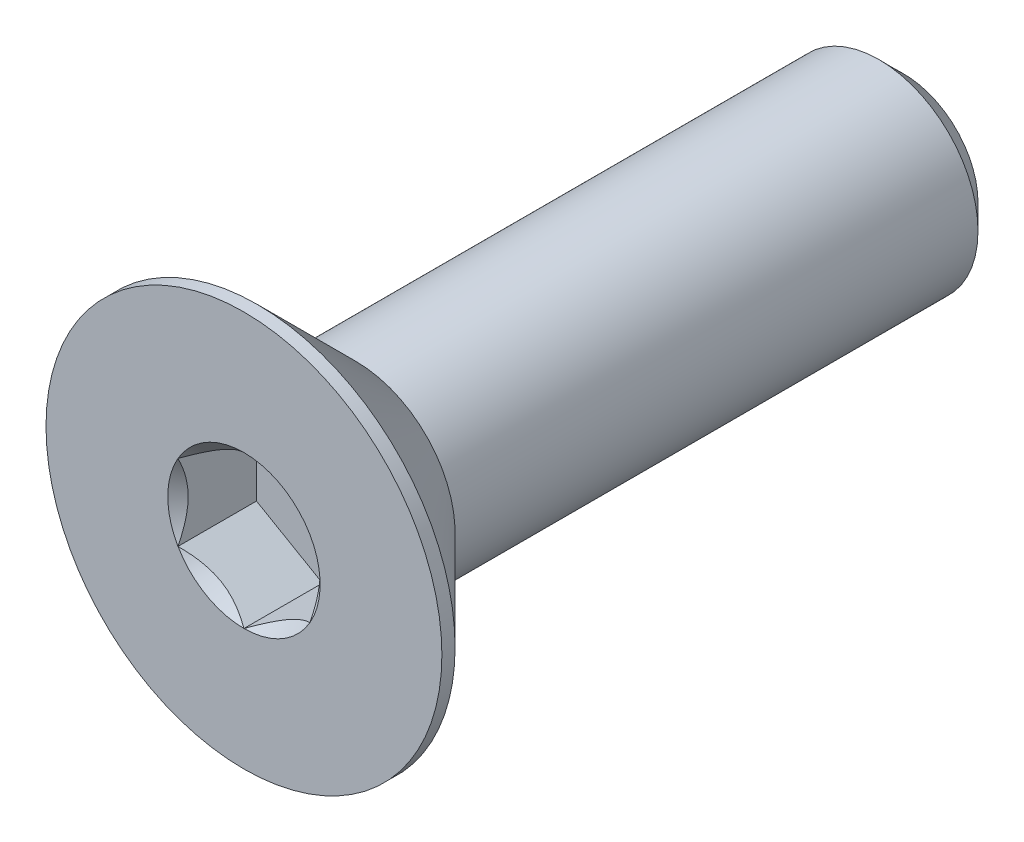
ISO-10303-21;
HEADER;
FILE_DESCRIPTION(('STEP AP214'),'2;1');
FILE_NAME('part.step','',(''),(''),'','','');
FILE_SCHEMA(('AUTOMOTIVE_DESIGN { 1 0 10303 214 1 1 1 1 }'));
ENDSEC;
DATA;
#1=APPLICATION_CONTEXT('core data for automotive mechanical design processes');
#2=APPLICATION_PROTOCOL_DEFINITION('international standard','automotive_design',2000,#1);
#3=PRODUCT_CONTEXT('',#1,'mechanical');
#4=PRODUCT('Part','Part','',(#3));
#5=PRODUCT_RELATED_PRODUCT_CATEGORY('part','',(#4));
#6=PRODUCT_DEFINITION_FORMATION('','',#4);
#7=PRODUCT_DEFINITION_CONTEXT('part definition',#1,'design');
#8=PRODUCT_DEFINITION('design','',#6,#7);
#9=PRODUCT_DEFINITION_SHAPE('','',#8);
#10=(LENGTH_UNIT() NAMED_UNIT(*) SI_UNIT(.MILLI.,.METRE.));
#11=(NAMED_UNIT(*) PLANE_ANGLE_UNIT() SI_UNIT($,.RADIAN.));
#12=(NAMED_UNIT(*) SI_UNIT($,.STERADIAN.) SOLID_ANGLE_UNIT());
#13=UNCERTAINTY_MEASURE_WITH_UNIT(LENGTH_MEASURE(1.E-05),#10,'distance_accuracy_value','');
#14=(GEOMETRIC_REPRESENTATION_CONTEXT(3) GLOBAL_UNCERTAINTY_ASSIGNED_CONTEXT((#13)) GLOBAL_UNIT_ASSIGNED_CONTEXT((#10,
#11,#12)) REPRESENTATION_CONTEXT('',''));
#15=CARTESIAN_POINT('',(0.,0.,0.));
#16=DIRECTION('',(0.,0.,1.));
#17=DIRECTION('',(1.,0.,0.));
#18=AXIS2_PLACEMENT_3D('',#15,#16,#17);
#19=CARTESIAN_POINT('',(1.,-0.577350269189626,-1.19));
#20=DIRECTION('',(0.,0.,1.));
#21=DIRECTION('',(1.,0.,0.));
#22=AXIS2_PLACEMENT_3D('',#19,#20,#21);
#23=PLANE('',#22);
#24=DIRECTION('',(0.,1.,0.));
#25=VECTOR('',#24,1.);
#26=CARTESIAN_POINT('',(-1.,0.577350269189626,-1.19));
#27=LINE('',#26,#25);
#28=CARTESIAN_POINT('',(-0.999999999999999,0.577350269189625,-1.19));
#29=VERTEX_POINT('',#28);
#30=CARTESIAN_POINT('',(-1.,-0.577350269189626,-1.19));
#31=VERTEX_POINT('',#30);
#32=EDGE_CURVE('E82',#29,#31,#27,.F.);
#33=ORIENTED_EDGE('',*,*,#32,.T.);
#34=DIRECTION('',(0.866025403784439,-0.5,0.));
#35=VECTOR('',#34,1.);
#36=CARTESIAN_POINT('',(-1.,-0.577350269189626,-1.19));
#37=LINE('',#36,#35);
#38=CARTESIAN_POINT('',(0.,-1.15470053837925,-1.19));
#39=VERTEX_POINT('',#38);
#40=EDGE_CURVE('E84',#31,#39,#37,.T.);
#41=ORIENTED_EDGE('',*,*,#40,.T.);
#42=DIRECTION('',(0.866025403784439,0.5,0.));
#43=VECTOR('',#42,1.);
#44=CARTESIAN_POINT('',(0.,-1.15470053837925,-1.19));
#45=LINE('',#44,#43);
#46=CARTESIAN_POINT('',(1.,-0.577350269189626,-1.19));
#47=VERTEX_POINT('',#46);
#48=EDGE_CURVE('E85',#39,#47,#45,.T.);
#49=ORIENTED_EDGE('',*,*,#48,.T.);
#50=DIRECTION('',(0.,1.,0.));
#51=VECTOR('',#50,1.);
#52=CARTESIAN_POINT('',(1.,-0.577350269189626,-1.19));
#53=LINE('',#52,#51);
#54=CARTESIAN_POINT('',(1.,0.577350269189626,-1.19));
#55=VERTEX_POINT('',#54);
#56=EDGE_CURVE('E71',#47,#55,#53,.T.);
#57=ORIENTED_EDGE('',*,*,#56,.T.);
#58=DIRECTION('',(-0.866025403784439,0.5,0.));
#59=VECTOR('',#58,1.);
#60=CARTESIAN_POINT('',(1.,0.577350269189626,-1.19));
#61=LINE('',#60,#59);
#62=CARTESIAN_POINT('',(0.,1.15470053837925,-1.19));
#63=VERTEX_POINT('',#62);
#64=EDGE_CURVE('E110',#55,#63,#61,.T.);
#65=ORIENTED_EDGE('',*,*,#64,.T.);
#66=DIRECTION('',(-0.866025403784439,-0.5,0.));
#67=VECTOR('',#66,1.);
#68=CARTESIAN_POINT('',(0.,1.15470053837925,-1.19));
#69=LINE('',#68,#67);
#70=EDGE_CURVE('E115',#63,#29,#69,.T.);
#71=ORIENTED_EDGE('',*,*,#70,.T.);
#72=EDGE_LOOP('',(#33,#41,#49,#57,#65,#71));
#73=FACE_BOUND('',#72,.T.);
#74=ADVANCED_FACE('F16',(#73),#23,.T.);
#75=CARTESIAN_POINT('',(0.,-1.15470053837925,-1.19));
#76=DIRECTION('',(0.5,-0.866025403784439,0.));
#77=DIRECTION('',(0.866025403784439,0.5,0.));
#78=AXIS2_PLACEMENT_3D('',#75,#76,#77);
#79=PLANE('',#78);
#80=CARTESIAN_POINT('',(-3.93149117159769E-11,-1.15470053837926,-9.98108794507433E-11));
#81=CARTESIAN_POINT('',(0.0343705355201057,-1.13485670043636,-0.019824700422141));
#82=CARTESIAN_POINT('',(0.0693156756519455,-1.11468111438035,-0.0384849664872145));
#83=CARTESIAN_POINT('',(0.140572403035621,-1.07354102364821,-0.0726511232407905));
#84=CARTESIAN_POINT('',(0.176890763106012,-1.05257260868342,-0.0881380101422933));
#85=CARTESIAN_POINT('',(0.250125097696328,-1.01029074589262,-0.11466695978462));
#86=CARTESIAN_POINT('',(0.287022429458597,-0.988988061467716,-0.125775687570534));
#87=CARTESIAN_POINT('',(0.361628600499482,-0.945914168534358,-0.142891513233382));
#88=CARTESIAN_POINT('',(0.399335163701569,-0.924144274119301,-0.148911380305544));
#89=CARTESIAN_POINT('',(0.464327716043936,-0.886620806529054,-0.154341115390247));
#90=CARTESIAN_POINT('',(0.491529304810035,-0.87091596193258,-0.155143433217331));
#91=CARTESIAN_POINT('',(0.545879708710831,-0.839536741609904,-0.153791220399352));
#92=CARTESIAN_POINT('',(0.573028510861523,-0.823862373380022,-0.151636036594819));
#93=CARTESIAN_POINT('',(0.654087027893978,-0.777063216751215,-0.140876680449877));
#94=CARTESIAN_POINT('',(0.707593237347495,-0.746171392319914,-0.127977491939688));
#95=CARTESIAN_POINT('',(0.801462739355952,-0.691975810066637,-0.0968623195341796));
#96=CARTESIAN_POINT('',(0.842267871071583,-0.668416956286299,-0.0802830124023648));
#97=CARTESIAN_POINT('',(0.922281198810023,-0.622221239977752,-0.0429387151524039));
#98=CARTESIAN_POINT('',(0.961494106307927,-0.599581657278129,-0.0221873504710733));
#99=CARTESIAN_POINT('',(1.00000000003183,-0.577350269171246,-1.09229319045489E-10));
#100=B_SPLINE_CURVE_WITH_KNOTS('',3,(#80,#81,#82,#83,#84,#85,#86,#87,#88,#89,#90,#91,#92,#93,
#94,#95,#96,#97,#98,#99),.UNSPECIFIED.,.F.,.F.,(4,2,2,2,2,2,2,2,2,4),(0.,0.133182946587487,
0.267141541479663,0.398973326833972,0.530473323727982,0.624596460473079,0.718740387507005,
0.907081600610891,1.05673041335255,1.20589820631879),.UNSPECIFIED.);
#101=CARTESIAN_POINT('',(0.,-1.15470053839843,-1.08428123155448E-10));
#102=VERTEX_POINT('',#101);
#103=CARTESIAN_POINT('',(1.00000000001661,-0.577350269199215,-1.08427884492241E-10));
#104=VERTEX_POINT('',#103);
#105=EDGE_CURVE('E19',#102,#104,#100,.T.);
#106=ORIENTED_EDGE('',*,*,#105,.T.);
#107=DIRECTION('',(0.,0.,-1.));
#108=VECTOR('',#107,1.);
#109=CARTESIAN_POINT('',(1.,-0.577350269189626,-1.19));
#110=LINE('',#109,#108);
#111=EDGE_CURVE('E90',#104,#47,#110,.T.);
#112=ORIENTED_EDGE('',*,*,#111,.T.);
#113=ORIENTED_EDGE('',*,*,#48,.F.);
#114=DIRECTION('',(0.,0.,1.));
#115=VECTOR('',#114,1.);
#116=CARTESIAN_POINT('',(0.,-1.15470053837925,-1.19));
#117=LINE('',#116,#115);
#118=EDGE_CURVE('E58',#39,#102,#117,.T.);
#119=ORIENTED_EDGE('',*,*,#118,.T.);
#120=EDGE_LOOP('',(#106,#112,#113,#119));
#121=FACE_BOUND('',#120,.T.);
#122=ADVANCED_FACE('F89',(#121),#79,.F.);
#123=CARTESIAN_POINT('',(-1.,-0.577350269189626,-1.19));
#124=DIRECTION('',(-0.5,-0.866025403784439,0.));
#125=DIRECTION('',(0.866025403784439,-0.5,0.));
#126=AXIS2_PLACEMENT_3D('',#123,#124,#125);
#127=PLANE('',#126);
#128=CARTESIAN_POINT('',(-1.00000000001966,-0.577350269155583,-9.98096276046598E-11));
#129=CARTESIAN_POINT('',(-0.965629464472823,-0.597194107120269,-0.0198247004221396));
#130=CARTESIAN_POINT('',(-0.930684324346155,-0.617369693185242,-0.0384849664872131));
#131=CARTESIAN_POINT('',(-0.859427596966287,-0.658509783923978,-0.0726511232407891));
#132=CARTESIAN_POINT('',(-0.823109236894494,-0.679478198886334,-0.0881380101422919));
#133=CARTESIAN_POINT('',(-0.749874902303172,-0.721760061675394,-0.114666959784619));
#134=CARTESIAN_POINT('',(-0.71297757054127,-0.743062746100931,-0.125775687570532));
#135=CARTESIAN_POINT('',(-0.638371399500649,-0.786136639034746,-0.14289151323338));
#136=CARTESIAN_POINT('',(-0.600664836298461,-0.807906533449627,-0.148911380305542));
#137=CARTESIAN_POINT('',(-0.535672283956042,-0.845430001039785,-0.154341115390246));
#138=CARTESIAN_POINT('',(-0.508470695189959,-0.861134845636286,-0.155143433217329));
#139=CARTESIAN_POINT('',(-0.454120291289175,-0.892514065958982,-0.15379122039935));
#140=CARTESIAN_POINT('',(-0.426971489138479,-0.908188434188858,-0.151636036594817));
#141=CARTESIAN_POINT('',(-0.345912972106017,-0.954987590817655,-0.140876680449876));
#142=CARTESIAN_POINT('',(-0.292406762652503,-0.985879415248961,-0.127977491939686));
#143=CARTESIAN_POINT('',(-0.198537260644048,-1.04007499750224,-0.0968623195341786));
#144=CARTESIAN_POINT('',(-0.157732128928417,-1.06363385128258,-0.0802830124023638));
#145=CARTESIAN_POINT('',(-0.0777188011899764,-1.10982956759112,-0.0429387151524029));
#146=CARTESIAN_POINT('',(-0.0385058936920724,-1.13246915029075,-0.0221873504710723));
#147=CARTESIAN_POINT('',(3.18328951443562E-11,-1.15470053839763,-1.09228385770901E-10));
#148=B_SPLINE_CURVE_WITH_KNOTS('',3,(#128,#129,#130,#131,#132,#133,#134,#135,#136,#137,#138,
#139,#140,#141,#142,#143,#144,#145,#146,#147),.UNSPECIFIED.,.F.,.F.,(4,2,2,2,2,2,2,2,2,4),(0.,
0.133182946587487,0.267141541479662,0.398973326833972,0.530473323727981,0.624596460473079,
0.718740387507004,0.907081600610891,1.05673041335255,1.20589820631879),.UNSPECIFIED.);
#149=CARTESIAN_POINT('',(-1.00000000001661,-0.577350269199216,-1.0842737551488E-10));
#150=VERTEX_POINT('',#149);
#151=EDGE_CURVE('E94',#150,#102,#148,.T.);
#152=ORIENTED_EDGE('',*,*,#151,.T.);
#153=ORIENTED_EDGE('',*,*,#118,.F.);
#154=ORIENTED_EDGE('',*,*,#40,.F.);
#155=DIRECTION('',(0.,0.,1.));
#156=VECTOR('',#155,1.);
#157=CARTESIAN_POINT('',(-1.,-0.577350269189626,-1.19));
#158=LINE('',#157,#156);
#159=EDGE_CURVE('E96',#31,#150,#158,.T.);
#160=ORIENTED_EDGE('',*,*,#159,.T.);
#161=EDGE_LOOP('',(#152,#153,#154,#160));
#162=FACE_BOUND('',#161,.T.);
#163=ADVANCED_FACE('F92',(#162),#127,.F.);
#164=CARTESIAN_POINT('',(-1.,0.577350269189626,-1.19));
#165=DIRECTION('',(-1.,0.,0.));
#166=DIRECTION('',(0.,0.,1.));
#167=AXIS2_PLACEMENT_3D('',#164,#165,#166);
#168=PLANE('',#167);
#169=CARTESIAN_POINT('',(-0.999999999980349,0.577350269223676,-9.98097329294954E-11));
#170=CARTESIAN_POINT('',(-0.999999999992929,0.537662593316093,-0.0198247004221396));
#171=CARTESIAN_POINT('',(-0.999999999998101,0.497311421195105,-0.0384849664872131));
#172=CARTESIAN_POINT('',(-1.00000000000191,0.41503123972423,-0.0726511232407892));
#173=CARTESIAN_POINT('',(-1.00000000000051,0.373094409797089,-0.0881380101422921));
#174=CARTESIAN_POINT('',(-0.999999999999501,0.288530684217224,-0.114666959784619));
#175=CARTESIAN_POINT('',(-0.999999999999868,0.245925315366786,-0.125775687570532));
#176=CARTESIAN_POINT('',(-1.00000000000013,0.159777529499614,-0.142891513233381));
#177=CARTESIAN_POINT('',(-1.00000000000003,0.116237740669674,-0.148911380305542));
#178=CARTESIAN_POINT('',(-0.999999999999979,0.0411908054892712,-0.154341115390246));
#179=CARTESIAN_POINT('',(-0.999999999999994,0.00978111629629506,-0.155143433217329));
#180=CARTESIAN_POINT('',(-1.00000000000001,-0.0529773243490767,-0.15379122039935));
#181=CARTESIAN_POINT('',(-1.,-0.0843260608088347,-0.151636036594817));
#182=CARTESIAN_POINT('',(-0.999999999999996,-0.177924374066439,-0.140876680449876));
#183=CARTESIAN_POINT('',(-0.999999999999999,-0.239708022929046,-0.127977491939686));
#184=CARTESIAN_POINT('',(-1.,-0.348099187435602,-0.0968623195341786));
#185=CARTESIAN_POINT('',(-1.,-0.395216894996278,-0.0802830124023637));
#186=CARTESIAN_POINT('',(-1.,-0.48760832761337,-0.0429387151524027));
#187=CARTESIAN_POINT('',(-0.999999999999999,-0.532887493012616,-0.0221873504710721));
#188=CARTESIAN_POINT('',(-1.,-0.577350269226384,-1.09228152961273E-10));
#189=B_SPLINE_CURVE_WITH_KNOTS('',3,(#169,#170,#171,#172,#173,#174,#175,#176,#177,#178,#179,
#180,#181,#182,#183,#184,#185,#186,#187,#188),.UNSPECIFIED.,.F.,.F.,(4,2,2,2,2,2,2,2,2,4),(0.,
0.133182946587487,0.267141541479662,0.398973326833972,0.530473323727981,0.624596460473079,
0.718740387507004,0.907081600610891,1.05673041335255,1.20589820631879),.UNSPECIFIED.);
#190=CARTESIAN_POINT('',(-1.00000000001661,0.577350269199215,-1.08428019358982E-10));
#191=VERTEX_POINT('',#190);
#192=EDGE_CURVE('E194',#191,#150,#189,.T.);
#193=ORIENTED_EDGE('',*,*,#192,.T.);
#194=ORIENTED_EDGE('',*,*,#159,.F.);
#195=ORIENTED_EDGE('',*,*,#32,.F.);
#196=DIRECTION('',(0.,0.,1.));
#197=VECTOR('',#196,1.);
#198=CARTESIAN_POINT('',(-0.999999999999999,0.577350269189625,-1.19));
#199=LINE('',#198,#197);
#200=EDGE_CURVE('E112',#29,#191,#199,.T.);
#201=ORIENTED_EDGE('',*,*,#200,.T.);
#202=EDGE_LOOP('',(#193,#194,#195,#201));
#203=FACE_BOUND('',#202,.T.);
#204=ADVANCED_FACE('F204',(#203),#168,.F.);
#205=CARTESIAN_POINT('',(0.,1.15470053837925,-1.19));
#206=DIRECTION('',(-0.5,0.866025403784439,0.));
#207=DIRECTION('',(-0.866025403784439,-0.5,0.));
#208=AXIS2_PLACEMENT_3D('',#205,#206,#207);
#209=PLANE('',#208);
#210=CARTESIAN_POINT('',(3.93151632829924E-11,1.15470053837926,-9.98107715657998E-11));
#211=CARTESIAN_POINT('',(-0.0343705355201053,1.13485670043636,-0.0198247004221408));
#212=CARTESIAN_POINT('',(-0.0693156756519452,1.11468111438035,-0.0384849664872144));
#213=CARTESIAN_POINT('',(-0.140572403035621,1.07354102364821,-0.0726511232407903));
#214=CARTESIAN_POINT('',(-0.176890763106012,1.05257260868342,-0.0881380101422931));
#215=CARTESIAN_POINT('',(-0.250125097696327,1.01029074589262,-0.11466695978462));
#216=CARTESIAN_POINT('',(-0.287022429458596,0.988988061467716,-0.125775687570534));
#217=CARTESIAN_POINT('',(-0.361628600499482,0.945914168534359,-0.142891513233382));
#218=CARTESIAN_POINT('',(-0.399335163701568,0.924144274119301,-0.148911380305543));
#219=CARTESIAN_POINT('',(-0.464327716043936,0.886620806529055,-0.154341115390247));
#220=CARTESIAN_POINT('',(-0.491529304810035,0.87091596193258,-0.155143433217331));
#221=CARTESIAN_POINT('',(-0.54587970871083,0.839536741609904,-0.153791220399352));
#222=CARTESIAN_POINT('',(-0.573028510861522,0.823862373380022,-0.151636036594819));
#223=CARTESIAN_POINT('',(-0.654087027893978,0.777063216751215,-0.140876680449878));
#224=CARTESIAN_POINT('',(-0.707593237347495,0.746171392319914,-0.127977491939688));
#225=CARTESIAN_POINT('',(-0.801462739355952,0.691975810066637,-0.0968623195341798));
#226=CARTESIAN_POINT('',(-0.842267871071583,0.668416956286299,-0.0802830124023649));
#227=CARTESIAN_POINT('',(-0.922281198810023,0.622221239977752,-0.0429387151524038));
#228=CARTESIAN_POINT('',(-0.961494106307926,0.599581657278129,-0.0221873504710732));
#229=CARTESIAN_POINT('',(-1.00000000003183,0.577350269171245,-1.09229129721644E-10));
#230=B_SPLINE_CURVE_WITH_KNOTS('',3,(#210,#211,#212,#213,#214,#215,#216,#217,#218,#219,#220,
#221,#222,#223,#224,#225,#226,#227,#228,#229),.UNSPECIFIED.,.F.,.F.,(4,2,2,2,2,2,2,2,2,4),(0.,
0.133182946587487,0.267141541479662,0.398973326833972,0.530473323727982,0.624596460473079,
0.718740387507005,0.907081600610891,1.05673041335255,1.20589820631879),.UNSPECIFIED.);
#231=CARTESIAN_POINT('',(0.,1.15470053839843,-1.08428125444796E-10));
#232=VERTEX_POINT('',#231);
#233=EDGE_CURVE('E186',#232,#191,#230,.T.);
#234=ORIENTED_EDGE('',*,*,#233,.T.);
#235=ORIENTED_EDGE('',*,*,#200,.F.);
#236=ORIENTED_EDGE('',*,*,#70,.F.);
#237=DIRECTION('',(0.,0.,1.));
#238=VECTOR('',#237,1.);
#239=CARTESIAN_POINT('',(0.,1.15470053837925,-1.19));
#240=LINE('',#239,#238);
#241=EDGE_CURVE('E107',#63,#232,#240,.T.);
#242=ORIENTED_EDGE('',*,*,#241,.T.);
#243=EDGE_LOOP('',(#234,#235,#236,#242));
#244=FACE_BOUND('',#243,.T.);
#245=ADVANCED_FACE('F200',(#244),#209,.F.);
#246=CARTESIAN_POINT('',(1.,0.577350269189626,-1.19));
#247=DIRECTION('',(0.5,0.866025403784439,0.));
#248=DIRECTION('',(-0.866025403784439,0.5,0.));
#249=AXIS2_PLACEMENT_3D('',#246,#247,#248);
#250=PLANE('',#249);
#251=CARTESIAN_POINT('',(1.00000000001966,0.577350269155583,-9.98095486581229E-11));
#252=CARTESIAN_POINT('',(0.965629464472823,0.597194107120269,-0.0198247004221397));
#253=CARTESIAN_POINT('',(0.930684324346155,0.617369693185242,-0.0384849664872132));
#254=CARTESIAN_POINT('',(0.859427596966287,0.658509783923978,-0.0726511232407891));
#255=CARTESIAN_POINT('',(0.823109236894494,0.679478198886334,-0.0881380101422918));
#256=CARTESIAN_POINT('',(0.749874902303172,0.721760061675394,-0.114666959784619));
#257=CARTESIAN_POINT('',(0.712977570541271,0.743062746100931,-0.125775687570532));
#258=CARTESIAN_POINT('',(0.638371399500649,0.786136639034746,-0.142891513233381));
#259=CARTESIAN_POINT('',(0.600664836298461,0.807906533449627,-0.148911380305542));
#260=CARTESIAN_POINT('',(0.535672283956042,0.845430001039784,-0.154341115390246));
#261=CARTESIAN_POINT('',(0.508470695189959,0.861134845636286,-0.155143433217329));
#262=CARTESIAN_POINT('',(0.454120291289175,0.892514065958982,-0.15379122039935));
#263=CARTESIAN_POINT('',(0.426971489138479,0.908188434188858,-0.151636036594817));
#264=CARTESIAN_POINT('',(0.345912972106017,0.954987590817654,-0.140876680449876));
#265=CARTESIAN_POINT('',(0.292406762652503,0.985879415248961,-0.127977491939686));
#266=CARTESIAN_POINT('',(0.198537260644048,1.04007499750224,-0.0968623195341785));
#267=CARTESIAN_POINT('',(0.157732128928417,1.06363385128258,-0.0802830124023638));
#268=CARTESIAN_POINT('',(0.0777188011899766,1.10982956759112,-0.042938715152403));
#269=CARTESIAN_POINT('',(0.0385058936920726,1.13246915029075,-0.0221873504710725));
#270=CARTESIAN_POINT('',(-3.18326351011692E-11,1.15470053839763,-1.0922858632033E-10));
#271=B_SPLINE_CURVE_WITH_KNOTS('',3,(#251,#252,#253,#254,#255,#256,#257,#258,#259,#260,#261,
#262,#263,#264,#265,#266,#267,#268,#269,#270),.UNSPECIFIED.,.F.,.F.,(4,2,2,2,2,2,2,2,2,4),(0.,
0.133182946587487,0.267141541479662,0.398973326833972,0.530473323727981,0.624596460473079,
0.718740387507004,0.907081600610891,1.05673041335255,1.20589820631879),.UNSPECIFIED.);
#272=CARTESIAN_POINT('',(1.00000000001661,0.577350269199216,-1.08427368443792E-10));
#273=VERTEX_POINT('',#272);
#274=EDGE_CURVE('E156',#273,#232,#271,.T.);
#275=ORIENTED_EDGE('',*,*,#274,.T.);
#276=ORIENTED_EDGE('',*,*,#241,.F.);
#277=ORIENTED_EDGE('',*,*,#64,.F.);
#278=DIRECTION('',(0.,0.,-1.));
#279=VECTOR('',#278,1.);
#280=CARTESIAN_POINT('',(1.,0.577350269189626,-1.19));
#281=LINE('',#280,#279);
#282=EDGE_CURVE('E39',#55,#273,#281,.F.);
#283=ORIENTED_EDGE('',*,*,#282,.T.);
#284=EDGE_LOOP('',(#275,#276,#277,#283));
#285=FACE_BOUND('',#284,.T.);
#286=ADVANCED_FACE('F203',(#285),#250,.F.);
#287=CARTESIAN_POINT('',(1.,-0.577350269189626,-1.19));
#288=DIRECTION('',(1.,0.,0.));
#289=DIRECTION('',(0.,0.,-1.));
#290=AXIS2_PLACEMENT_3D('',#287,#288,#289);
#291=PLANE('',#290);
#292=CARTESIAN_POINT('',(0.999999999980349,-0.577350269223676,-9.98095949384892E-11));
#293=CARTESIAN_POINT('',(0.999999999992929,-0.537662593316093,-0.0198247004221395));
#294=CARTESIAN_POINT('',(0.999999999998101,-0.497311421195106,-0.0384849664872131));
#295=CARTESIAN_POINT('',(1.00000000000191,-0.41503123972423,-0.0726511232407892));
#296=CARTESIAN_POINT('',(1.00000000000051,-0.373094409797089,-0.0881380101422921));
#297=CARTESIAN_POINT('',(0.999999999999501,-0.288530684217224,-0.114666959784619));
#298=CARTESIAN_POINT('',(0.999999999999868,-0.245925315366786,-0.125775687570532));
#299=CARTESIAN_POINT('',(1.00000000000013,-0.159777529499614,-0.142891513233381));
#300=CARTESIAN_POINT('',(1.00000000000003,-0.116237740669674,-0.148911380305542));
#301=CARTESIAN_POINT('',(0.999999999999979,-0.0411908054892709,-0.154341115390246));
#302=CARTESIAN_POINT('',(0.999999999999994,-0.00978111629629477,-0.155143433217329));
#303=CARTESIAN_POINT('',(1.00000000000001,0.052977324349077,-0.15379122039935));
#304=CARTESIAN_POINT('',(1.,0.084326060808835,-0.151636036594817));
#305=CARTESIAN_POINT('',(0.999999999999996,0.177924374066439,-0.140876680449876));
#306=CARTESIAN_POINT('',(0.999999999999999,0.239708022929047,-0.127977491939686));
#307=CARTESIAN_POINT('',(1.,0.348099187435603,-0.0968623195341784));
#308=CARTESIAN_POINT('',(1.,0.395216894996278,-0.0802830124023636));
#309=CARTESIAN_POINT('',(1.,0.48760832761337,-0.0429387151524028));
#310=CARTESIAN_POINT('',(0.999999999999999,0.532887493012616,-0.0221873504710722));
#311=CARTESIAN_POINT('',(1.,0.577350269226384,-1.09228152479802E-10));
#312=B_SPLINE_CURVE_WITH_KNOTS('',3,(#292,#293,#294,#295,#296,#297,#298,#299,#300,#301,#302,
#303,#304,#305,#306,#307,#308,#309,#310,#311),.UNSPECIFIED.,.F.,.F.,(4,2,2,2,2,2,2,2,2,4),(0.,
0.133182946587487,0.267141541479663,0.398973326833972,0.530473323727982,0.624596460473079,
0.718740387507005,0.907081600610892,1.05673041335255,1.20589820631879),.UNSPECIFIED.);
#313=EDGE_CURVE('E148',#104,#273,#312,.T.);
#314=ORIENTED_EDGE('',*,*,#313,.T.);
#315=ORIENTED_EDGE('',*,*,#282,.F.);
#316=ORIENTED_EDGE('',*,*,#56,.F.);
#317=ORIENTED_EDGE('',*,*,#111,.F.);
#318=EDGE_LOOP('',(#314,#315,#316,#317));
#319=FACE_BOUND('',#318,.T.);
#320=ADVANCED_FACE('F164',(#319),#291,.F.);
#321=CARTESIAN_POINT('',(0.,0.,-1.70530256582424E-10));
#322=DIRECTION('',(0.,0.,1.));
#323=DIRECTION('',(1.,0.,0.));
#324=AXIS2_PLACEMENT_3D('',#321,#322,#323);
#325=CONICAL_SURFACE('',#324,1.15470053833633,0.785398163397448);
#326=ORIENTED_EDGE('',*,*,#105,.F.);
#327=CARTESIAN_POINT('',(0.,0.,-1.13686837721616E-10));
#328=DIRECTION('',(0.,0.,1.));
#329=DIRECTION('',(1.,0.,0.));
#330=AXIS2_PLACEMENT_3D('',#327,#328,#329);
#331=CIRCLE('',#330,1.15470053839317);
#332=EDGE_CURVE('E145',#104,#102,#331,.F.);
#333=ORIENTED_EDGE('',*,*,#332,.F.);
#334=EDGE_LOOP('',(#326,#333));
#335=FACE_BOUND('',#334,.T.);
#336=ADVANCED_FACE('F221',(#335),#325,.F.);
#337=CARTESIAN_POINT('',(0.,0.,-1.70530256582424E-10));
#338=DIRECTION('',(0.,0.,1.));
#339=DIRECTION('',(1.,0.,0.));
#340=AXIS2_PLACEMENT_3D('',#337,#338,#339);
#341=CONICAL_SURFACE('',#340,1.15470053833633,0.785398163397448);
#342=ORIENTED_EDGE('',*,*,#151,.F.);
#343=CARTESIAN_POINT('',(0.,0.,-1.13686837721616E-10));
#344=DIRECTION('',(0.,0.,1.));
#345=DIRECTION('',(1.,0.,0.));
#346=AXIS2_PLACEMENT_3D('',#343,#344,#345);
#347=CIRCLE('',#346,1.15470053839317);
#348=EDGE_CURVE('E142',#102,#150,#347,.F.);
#349=ORIENTED_EDGE('',*,*,#348,.F.);
#350=EDGE_LOOP('',(#342,#349));
#351=FACE_BOUND('',#350,.T.);
#352=ADVANCED_FACE('F218',(#351),#341,.F.);
#353=CARTESIAN_POINT('',(0.,0.,-1.70530256582424E-10));
#354=DIRECTION('',(0.,0.,1.));
#355=DIRECTION('',(1.,0.,0.));
#356=AXIS2_PLACEMENT_3D('',#353,#354,#355);
#357=CONICAL_SURFACE('',#356,1.15470053833633,0.785398163397448);
#358=ORIENTED_EDGE('',*,*,#192,.F.);
#359=CARTESIAN_POINT('',(0.,0.,-1.13686837721616E-10));
#360=DIRECTION('',(0.,0.,1.));
#361=DIRECTION('',(1.,0.,0.));
#362=AXIS2_PLACEMENT_3D('',#359,#360,#361);
#363=CIRCLE('',#362,1.15470053839317);
#364=EDGE_CURVE('E139',#150,#191,#363,.F.);
#365=ORIENTED_EDGE('',*,*,#364,.F.);
#366=EDGE_LOOP('',(#358,#365));
#367=FACE_BOUND('',#366,.T.);
#368=ADVANCED_FACE('F182',(#367),#357,.F.);
#369=CARTESIAN_POINT('',(0.,0.,-1.70530256582424E-10));
#370=DIRECTION('',(0.,0.,1.));
#371=DIRECTION('',(1.,0.,0.));
#372=AXIS2_PLACEMENT_3D('',#369,#370,#371);
#373=CONICAL_SURFACE('',#372,1.15470053833633,0.785398163397448);
#374=ORIENTED_EDGE('',*,*,#233,.F.);
#375=CARTESIAN_POINT('',(0.,0.,-1.13686837721616E-10));
#376=DIRECTION('',(0.,0.,1.));
#377=DIRECTION('',(1.,0.,0.));
#378=AXIS2_PLACEMENT_3D('',#375,#376,#377);
#379=CIRCLE('',#378,1.15470053839317);
#380=EDGE_CURVE('E136',#191,#232,#379,.F.);
#381=ORIENTED_EDGE('',*,*,#380,.F.);
#382=EDGE_LOOP('',(#374,#381));
#383=FACE_BOUND('',#382,.T.);
#384=ADVANCED_FACE('F177',(#383),#373,.F.);
#385=CARTESIAN_POINT('',(0.,0.,-1.70530256582424E-10));
#386=DIRECTION('',(0.,0.,1.));
#387=DIRECTION('',(1.,0.,0.));
#388=AXIS2_PLACEMENT_3D('',#385,#386,#387);
#389=CONICAL_SURFACE('',#388,1.15470053833633,0.785398163397448);
#390=ORIENTED_EDGE('',*,*,#274,.F.);
#391=CARTESIAN_POINT('',(0.,0.,-1.13686837721616E-10));
#392=DIRECTION('',(0.,0.,1.));
#393=DIRECTION('',(1.,0.,0.));
#394=AXIS2_PLACEMENT_3D('',#391,#392,#393);
#395=CIRCLE('',#394,1.15470053839317);
#396=EDGE_CURVE('E133',#232,#273,#395,.F.);
#397=ORIENTED_EDGE('',*,*,#396,.F.);
#398=EDGE_LOOP('',(#390,#397));
#399=FACE_BOUND('',#398,.T.);
#400=ADVANCED_FACE('F171',(#399),#389,.F.);
#401=CARTESIAN_POINT('',(0.,0.,-1.70530256582424E-10));
#402=DIRECTION('',(0.,0.,1.));
#403=DIRECTION('',(1.,0.,0.));
#404=AXIS2_PLACEMENT_3D('',#401,#402,#403);
#405=CONICAL_SURFACE('',#404,1.15470053833633,0.785398163397448);
#406=CARTESIAN_POINT('',(0.,0.,-1.13686837721616E-10));
#407=DIRECTION('',(0.,0.,1.));
#408=DIRECTION('',(1.,0.,0.));
#409=AXIS2_PLACEMENT_3D('',#406,#407,#408);
#410=CIRCLE('',#409,1.15470053839317);
#411=EDGE_CURVE('E130',#273,#104,#410,.F.);
#412=ORIENTED_EDGE('',*,*,#411,.F.);
#413=ORIENTED_EDGE('',*,*,#313,.F.);
#414=EDGE_LOOP('',(#412,#413));
#415=FACE_BOUND('',#414,.T.);
#416=ADVANCED_FACE('F166',(#415),#405,.F.);
#417=CARTESIAN_POINT('',(0.,-1.5,0.));
#418=DIRECTION('',(0.,0.,1.));
#419=DIRECTION('',(0.,-1.,0.));
#420=AXIS2_PLACEMENT_3D('',#417,#418,#419);
#421=PLANE('',#420);
#422=ORIENTED_EDGE('',*,*,#396,.T.);
#423=ORIENTED_EDGE('',*,*,#411,.T.);
#424=ORIENTED_EDGE('',*,*,#332,.T.);
#425=ORIENTED_EDGE('',*,*,#348,.T.);
#426=ORIENTED_EDGE('',*,*,#364,.T.);
#427=ORIENTED_EDGE('',*,*,#380,.T.);
#428=EDGE_LOOP('',(#422,#423,#424,#425,#426,#427));
#429=FACE_BOUND('',#428,.T.);
#430=CARTESIAN_POINT('',(0.,0.,0.));
#431=DIRECTION('',(0.,0.,1.));
#432=DIRECTION('',(0.,-1.,0.));
#433=AXIS2_PLACEMENT_3D('',#430,#431,#432);
#434=CIRCLE('',#433,3.);
#435=CARTESIAN_POINT('',(0.,-3.,0.));
#436=VERTEX_POINT('',#435);
#437=EDGE_CURVE('E127',#436,#436,#434,.F.);
#438=ORIENTED_EDGE('',*,*,#437,.F.);
#439=EDGE_LOOP('',(#438));
#440=FACE_BOUND('',#439,.T.);
#441=ADVANCED_FACE('F170',(#429,#440),#421,.T.);
#442=CARTESIAN_POINT('',(0.,-1.5,-10.));
#443=DIRECTION('',(0.,0.,-1.));
#444=DIRECTION('',(0.,1.,0.));
#445=AXIS2_PLACEMENT_3D('',#442,#443,#444);
#446=PLANE('',#445);
#447=CARTESIAN_POINT('',(0.,0.,-10.0000000000477));
#448=DIRECTION('',(0.,0.,1.));
#449=DIRECTION('',(1.,0.,0.));
#450=AXIS2_PLACEMENT_3D('',#447,#448,#449);
#451=CIRCLE('',#450,1.12499999988813);
#452=CARTESIAN_POINT('',(1.12499999988813,0.,-10.0000000000477));
#453=VERTEX_POINT('',#452);
#454=EDGE_CURVE('E123',#453,#453,#451,.T.);
#455=ORIENTED_EDGE('',*,*,#454,.F.);
#456=EDGE_LOOP('',(#455));
#457=FACE_BOUND('',#456,.T.);
#458=ADVANCED_FACE('F249',(#457),#446,.T.);
#459=CARTESIAN_POINT('',(0.,0.,0.));
#460=DIRECTION('',(0.,0.,1.));
#461=DIRECTION('',(0.,-1.,0.));
#462=AXIS2_PLACEMENT_3D('',#459,#460,#461);
#463=CYLINDRICAL_SURFACE('',#462,3.);
#464=CARTESIAN_POINT('',(0.,0.,-0.200000000006641));
#465=DIRECTION('',(0.,0.,1.));
#466=DIRECTION('',(0.,-1.,0.));
#467=AXIS2_PLACEMENT_3D('',#464,#465,#466);
#468=CIRCLE('',#467,3.00000000004275);
#469=CARTESIAN_POINT('',(0.,-3.00000000004275,-0.200000000006639));
#470=VERTEX_POINT('',#469);
#471=EDGE_CURVE('E126',#470,#470,#468,.F.);
#472=ORIENTED_EDGE('',*,*,#471,.F.);
#473=EDGE_LOOP('',(#472));
#474=FACE_BOUND('',#473,.T.);
#475=ORIENTED_EDGE('',*,*,#437,.T.);
#476=EDGE_LOOP('',(#475));
#477=FACE_BOUND('',#476,.T.);
#478=ADVANCED_FACE('F246',(#474,#477),#463,.T.);
#479=CARTESIAN_POINT('',(0.,0.,-9.62499999997135));
#480=DIRECTION('',(0.,0.,1.));
#481=DIRECTION('',(1.,0.,0.));
#482=AXIS2_PLACEMENT_3D('',#479,#480,#481);
#483=CONICAL_SURFACE('',#482,1.50000000002137,0.78539816347324);
#484=ORIENTED_EDGE('',*,*,#454,.T.);
#485=EDGE_LOOP('',(#484));
#486=FACE_BOUND('',#485,.T.);
#487=CARTESIAN_POINT('',(0.,0.,-9.62499999999999));
#488=DIRECTION('',(0.,0.,-1.));
#489=DIRECTION('',(0.,1.,0.));
#490=AXIS2_PLACEMENT_3D('',#487,#488,#489);
#491=CIRCLE('',#490,1.5);
#492=CARTESIAN_POINT('',(0.,1.5,-9.62499999999999));
#493=VERTEX_POINT('',#492);
#494=EDGE_CURVE('E30',#493,#493,#491,.F.);
#495=ORIENTED_EDGE('',*,*,#494,.F.);
#496=EDGE_LOOP('',(#495));
#497=FACE_BOUND('',#496,.T.);
#498=ADVANCED_FACE('F239',(#486,#497),#483,.T.);
#499=CARTESIAN_POINT('',(0.,0.,-0.200000000177172));
#500=DIRECTION('',(0.,0.,1.));
#501=DIRECTION('',(0.,-1.,0.));
#502=AXIS2_PLACEMENT_3D('',#499,#500,#501);
#503=CONICAL_SURFACE('',#502,2.99999999987222,0.785398163397449);
#504=CARTESIAN_POINT('',(0.,0.,-1.7));
#505=DIRECTION('',(0.,0.,-1.));
#506=DIRECTION('',(0.,1.,0.));
#507=AXIS2_PLACEMENT_3D('',#504,#505,#506);
#508=CIRCLE('',#507,1.5);
#509=CARTESIAN_POINT('',(0.,1.5,-1.7));
#510=VERTEX_POINT('',#509);
#511=EDGE_CURVE('E10',#510,#510,#508,.T.);
#512=ORIENTED_EDGE('',*,*,#511,.F.);
#513=EDGE_LOOP('',(#512));
#514=FACE_BOUND('',#513,.T.);
#515=ORIENTED_EDGE('',*,*,#471,.T.);
#516=EDGE_LOOP('',(#515));
#517=FACE_BOUND('',#516,.T.);
#518=ADVANCED_FACE('F233',(#514,#517),#503,.T.);
#519=CARTESIAN_POINT('',(0.,0.,-10.));
#520=DIRECTION('',(0.,0.,-1.));
#521=DIRECTION('',(0.,1.,0.));
#522=AXIS2_PLACEMENT_3D('',#519,#520,#521);
#523=CYLINDRICAL_SURFACE('',#522,1.5);
#524=ORIENTED_EDGE('',*,*,#511,.T.);
#525=EDGE_LOOP('',(#524));
#526=FACE_BOUND('',#525,.T.);
#527=ORIENTED_EDGE('',*,*,#494,.T.);
#528=EDGE_LOOP('',(#527));
#529=FACE_BOUND('',#528,.T.);
#530=ADVANCED_FACE('F231',(#526,#529),#523,.T.);
#531=CLOSED_SHELL('',(#74,#122,#163,#204,#245,#286,#320,#336,#352,#368,#384,#400,#416,#441,#458,
#478,#498,#518,#530));
#532=MANIFOLD_SOLID_BREP('B1',#531);
#533=ADVANCED_BREP_SHAPE_REPRESENTATION('',(#18,#532),#14);
#534=SHAPE_DEFINITION_REPRESENTATION(#9,#533);
ENDSEC;
END-ISO-10303-21;
